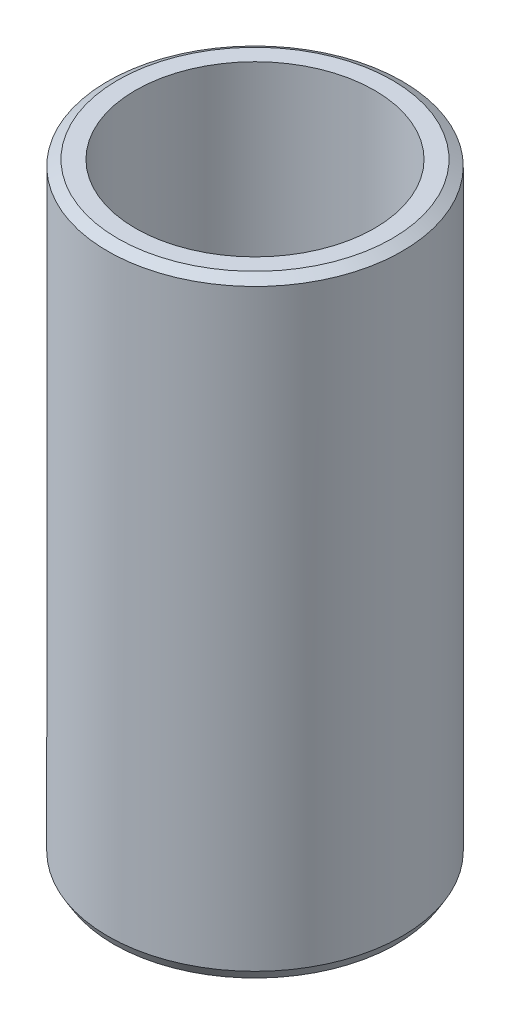
ISO-10303-21;
HEADER;
FILE_DESCRIPTION(('STEP AP214'),'2;1');
FILE_NAME('part.step','',(''),(''),'','','');
FILE_SCHEMA(('AUTOMOTIVE_DESIGN { 1 0 10303 214 1 1 1 1 }'));
ENDSEC;
DATA;
#1=APPLICATION_CONTEXT('core data for automotive mechanical design processes');
#2=APPLICATION_PROTOCOL_DEFINITION('international standard','automotive_design',2000,#1);
#3=PRODUCT_CONTEXT('',#1,'mechanical');
#4=PRODUCT('Part','Part','',(#3));
#5=PRODUCT_RELATED_PRODUCT_CATEGORY('part','',(#4));
#6=PRODUCT_DEFINITION_FORMATION('','',#4);
#7=PRODUCT_DEFINITION_CONTEXT('part definition',#1,'design');
#8=PRODUCT_DEFINITION('design','',#6,#7);
#9=PRODUCT_DEFINITION_SHAPE('','',#8);
#10=(LENGTH_UNIT() NAMED_UNIT(*) SI_UNIT(.MILLI.,.METRE.));
#11=(NAMED_UNIT(*) PLANE_ANGLE_UNIT() SI_UNIT($,.RADIAN.));
#12=(NAMED_UNIT(*) SI_UNIT($,.STERADIAN.) SOLID_ANGLE_UNIT());
#13=UNCERTAINTY_MEASURE_WITH_UNIT(LENGTH_MEASURE(1.E-05),#10,'distance_accuracy_value','');
#14=(GEOMETRIC_REPRESENTATION_CONTEXT(3) GLOBAL_UNCERTAINTY_ASSIGNED_CONTEXT((#13)) GLOBAL_UNIT_ASSIGNED_CONTEXT((#10,
#11,#12)) REPRESENTATION_CONTEXT('',''));
#15=CARTESIAN_POINT('',(0.,0.,0.));
#16=DIRECTION('',(0.,0.,1.));
#17=DIRECTION('',(1.,0.,0.));
#18=AXIS2_PLACEMENT_3D('',#15,#16,#17);
#19=CARTESIAN_POINT('',(0.,196.485747585131,0.));
#20=DIRECTION('',(0.,-1.,0.));
#21=DIRECTION('',(0.,0.,-1.));
#22=AXIS2_PLACEMENT_3D('',#19,#20,#21);
#23=CYLINDRICAL_SURFACE('',#22,47.5);
#24=CARTESIAN_POINT('',(0.,194.548797503286,0.));
#25=DIRECTION('',(0.,1.,0.));
#26=DIRECTION('',(0.,0.,1.));
#27=AXIS2_PLACEMENT_3D('',#24,#25,#26);
#28=CIRCLE('',#27,47.5);
#29=CARTESIAN_POINT('',(0.,194.548797503286,-47.5));
#30=VERTEX_POINT('',#29);
#31=EDGE_CURVE('E50',#30,#30,#28,.F.);
#32=ORIENTED_EDGE('',*,*,#31,.T.);
#33=EDGE_LOOP('',(#32));
#34=FACE_BOUND('',#33,.T.);
#35=CARTESIAN_POINT('',(0.,3.24365106532762,0.));
#36=DIRECTION('',(0.,1.,0.));
#37=DIRECTION('',(0.,0.,1.));
#38=AXIS2_PLACEMENT_3D('',#35,#36,#37);
#39=CIRCLE('',#38,47.5);
#40=CARTESIAN_POINT('',(0.,3.24365106532762,47.5));
#41=VERTEX_POINT('',#40);
#42=EDGE_CURVE('E51',#41,#41,#39,.T.);
#43=ORIENTED_EDGE('',*,*,#42,.T.);
#44=EDGE_LOOP('',(#43));
#45=FACE_BOUND('',#44,.T.);
#46=ADVANCED_FACE('F39',(#34,#45),#23,.T.);
#47=CARTESIAN_POINT('',(0.,196.485747585131,0.));
#48=DIRECTION('',(0.,1.,0.));
#49=DIRECTION('',(0.,0.,1.));
#50=AXIS2_PLACEMENT_3D('',#47,#48,#49);
#51=PLANE('',#50);
#52=CARTESIAN_POINT('',(0.,196.485747585131,0.));
#53=DIRECTION('',(0.,1.,0.));
#54=DIRECTION('',(0.,0.,1.));
#55=AXIS2_PLACEMENT_3D('',#52,#53,#54);
#56=CIRCLE('',#55,44.2563489346723);
#57=CARTESIAN_POINT('',(0.,196.485747585131,-44.2563489346724));
#58=VERTEX_POINT('',#57);
#59=EDGE_CURVE('E54',#58,#58,#56,.T.);
#60=ORIENTED_EDGE('',*,*,#59,.T.);
#61=EDGE_LOOP('',(#60));
#62=FACE_BOUND('',#61,.T.);
#63=CARTESIAN_POINT('',(0.,196.485747585131,0.));
#64=DIRECTION('',(0.,1.,0.));
#65=DIRECTION('',(0.,0.,1.));
#66=AXIS2_PLACEMENT_3D('',#63,#64,#65);
#67=CIRCLE('',#66,38.5580430725887);
#68=CARTESIAN_POINT('',(0.,196.485747585131,38.5580430725887));
#69=VERTEX_POINT('',#68);
#70=EDGE_CURVE('E58',#69,#69,#67,.T.);
#71=ORIENTED_EDGE('',*,*,#70,.F.);
#72=EDGE_LOOP('',(#71));
#73=FACE_BOUND('',#72,.T.);
#74=ADVANCED_FACE('F69',(#62,#73),#51,.T.);
#75=CARTESIAN_POINT('',(0.,0.,0.));
#76=DIRECTION('',(0.,1.,0.));
#77=DIRECTION('',(0.,0.,1.));
#78=AXIS2_PLACEMENT_3D('',#75,#76,#77);
#79=PLANE('',#78);
#80=CARTESIAN_POINT('',(0.,0.,0.));
#81=DIRECTION('',(0.,1.,0.));
#82=DIRECTION('',(0.,0.,1.));
#83=AXIS2_PLACEMENT_3D('',#80,#81,#82);
#84=CIRCLE('',#83,45.5630499181547);
#85=CARTESIAN_POINT('',(0.,0.,45.5630499181547));
#86=VERTEX_POINT('',#85);
#87=EDGE_CURVE('E10',#86,#86,#84,.F.);
#88=ORIENTED_EDGE('',*,*,#87,.T.);
#89=EDGE_LOOP('',(#88));
#90=FACE_BOUND('',#89,.T.);
#91=CARTESIAN_POINT('',(0.,0.,0.));
#92=DIRECTION('',(0.,1.,0.));
#93=DIRECTION('',(0.,0.,1.));
#94=AXIS2_PLACEMENT_3D('',#91,#92,#93);
#95=CIRCLE('',#94,38.5580430725887);
#96=CARTESIAN_POINT('',(0.,0.,38.5580430725887));
#97=VERTEX_POINT('',#96);
#98=EDGE_CURVE('E63',#97,#97,#95,.T.);
#99=ORIENTED_EDGE('',*,*,#98,.T.);
#100=EDGE_LOOP('',(#99));
#101=FACE_BOUND('',#100,.T.);
#102=ADVANCED_FACE('F75',(#90,#101),#79,.F.);
#103=CARTESIAN_POINT('',(0.,196.485747585131,0.));
#104=DIRECTION('',(0.,-1.,0.));
#105=DIRECTION('',(0.,0.,-1.));
#106=AXIS2_PLACEMENT_3D('',#103,#104,#105);
#107=CYLINDRICAL_SURFACE('',#106,38.5580430725887);
#108=ORIENTED_EDGE('',*,*,#70,.T.);
#109=EDGE_LOOP('',(#108));
#110=FACE_BOUND('',#109,.T.);
#111=ORIENTED_EDGE('',*,*,#98,.F.);
#112=EDGE_LOOP('',(#111));
#113=FACE_BOUND('',#112,.T.);
#114=ADVANCED_FACE('F70',(#110,#113),#107,.F.);
#115=CARTESIAN_POINT('',(0.,196.485747585131,0.));
#116=DIRECTION('',(0.,-1.,0.));
#117=DIRECTION('',(0.,0.,-1.));
#118=AXIS2_PLACEMENT_3D('',#115,#116,#117);
#119=CONICAL_SURFACE('',#118,44.2563489346723,1.03247417536392);
#120=CARTESIAN_POINT('',(0.,194.548797503286,-47.5));
#121=CARTESIAN_POINT('',(0.,194.568974066639,-47.4662119680695));
#122=CARTESIAN_POINT('',(0.,194.589150629991,-47.432423936139));
#123=CARTESIAN_POINT('',(0.,194.629503756696,-47.364847872278));
#124=CARTESIAN_POINT('',(0.,194.649680320049,-47.3310598403475));
#125=CARTESIAN_POINT('',(0.,194.690033446754,-47.2634837764866));
#126=CARTESIAN_POINT('',(0.,194.710210010106,-47.2296957445561));
#127=CARTESIAN_POINT('',(0.,194.750563136812,-47.1621196806951));
#128=CARTESIAN_POINT('',(0.,194.770739700164,-47.1283316487646));
#129=CARTESIAN_POINT('',(0.,194.811092826869,-47.0607555849036));
#130=CARTESIAN_POINT('',(0.,194.831269390222,-47.0269675529731));
#131=CARTESIAN_POINT('',(0.,194.871622516927,-46.9593914891121));
#132=CARTESIAN_POINT('',(0.,194.891799080279,-46.9256034571816));
#133=CARTESIAN_POINT('',(0.,194.932152206985,-46.8580273933206));
#134=CARTESIAN_POINT('',(0.,194.952328770337,-46.8242393613901));
#135=CARTESIAN_POINT('',(0.,194.992681897042,-46.7566632975291));
#136=CARTESIAN_POINT('',(0.,195.012858460395,-46.7228752655986));
#137=CARTESIAN_POINT('',(0.,195.0532115871,-46.6552992017376));
#138=CARTESIAN_POINT('',(0.,195.073388150452,-46.6215111698071));
#139=CARTESIAN_POINT('',(0.,195.113741277158,-46.5539351059461));
#140=CARTESIAN_POINT('',(0.,195.13391784051,-46.5201470740156));
#141=CARTESIAN_POINT('',(0.,195.174270967215,-46.4525710101546));
#142=CARTESIAN_POINT('',(0.,195.194447530568,-46.4187829782241));
#143=CARTESIAN_POINT('',(0.,195.234800657273,-46.3512069143632));
#144=CARTESIAN_POINT('',(0.,195.254977220625,-46.3174188824327));
#145=CARTESIAN_POINT('',(0.,195.295330347331,-46.2498428185717));
#146=CARTESIAN_POINT('',(0.,195.315506910683,-46.2160547866412));
#147=CARTESIAN_POINT('',(0.,195.355860037388,-46.1484787227802));
#148=CARTESIAN_POINT('',(0.,195.376036600741,-46.1146906908497));
#149=CARTESIAN_POINT('',(0.,195.416389727446,-46.0471146269887));
#150=CARTESIAN_POINT('',(0.,195.436566290798,-46.0133265950582));
#151=CARTESIAN_POINT('',(0.,195.476919417504,-45.9457505311972));
#152=CARTESIAN_POINT('',(0.,195.497095980856,-45.9119624992667));
#153=CARTESIAN_POINT('',(0.,195.537449107561,-45.8443864354057));
#154=CARTESIAN_POINT('',(0.,195.557625670914,-45.8105984034752));
#155=CARTESIAN_POINT('',(0.,195.597978797619,-45.7430223396142));
#156=CARTESIAN_POINT('',(0.,195.618155360971,-45.7092343076837));
#157=CARTESIAN_POINT('',(0.,195.658508487677,-45.6416582438227));
#158=CARTESIAN_POINT('',(0.,195.678685051029,-45.6078702118922));
#159=CARTESIAN_POINT('',(0.,195.719038177734,-45.5402941480312));
#160=CARTESIAN_POINT('',(0.,195.739214741087,-45.5065061161007));
#161=CARTESIAN_POINT('',(0.,195.779567867792,-45.4389300522397));
#162=CARTESIAN_POINT('',(0.,195.799744431144,-45.4051420203092));
#163=CARTESIAN_POINT('',(0.,195.84009755785,-45.3375659564483));
#164=CARTESIAN_POINT('',(0.,195.860274121202,-45.3037779245178));
#165=CARTESIAN_POINT('',(0.,195.900627247907,-45.2362018606568));
#166=CARTESIAN_POINT('',(0.,195.92080381126,-45.2024138287263));
#167=CARTESIAN_POINT('',(0.,195.961156937965,-45.1348377648653));
#168=CARTESIAN_POINT('',(0.,195.981333501317,-45.1010497329348));
#169=CARTESIAN_POINT('',(0.,196.021686628023,-45.0334736690738));
#170=CARTESIAN_POINT('',(0.,196.041863191375,-44.9996856371433));
#171=CARTESIAN_POINT('',(0.,196.08221631808,-44.9321095732823));
#172=CARTESIAN_POINT('',(0.,196.102392881433,-44.8983215413518));
#173=CARTESIAN_POINT('',(0.,196.142746008138,-44.8307454774908));
#174=CARTESIAN_POINT('',(0.,196.16292257149,-44.7969574455603));
#175=CARTESIAN_POINT('',(0.,196.203275698196,-44.7293813816993));
#176=CARTESIAN_POINT('',(0.,196.223452261548,-44.6955933497688));
#177=CARTESIAN_POINT('',(0.,196.263805388253,-44.6280172859078));
#178=CARTESIAN_POINT('',(0.,196.283981951606,-44.5942292539773));
#179=CARTESIAN_POINT('',(0.,196.324335078311,-44.5266531901163));
#180=CARTESIAN_POINT('',(0.,196.344511641663,-44.4928651581858));
#181=CARTESIAN_POINT('',(0.,196.384864768369,-44.4252890943249));
#182=CARTESIAN_POINT('',(0.,196.405041331721,-44.3915010623944));
#183=CARTESIAN_POINT('',(0.,196.445394458426,-44.3239249985334));
#184=CARTESIAN_POINT('',(0.,196.465571021779,-44.2901369666029));
#185=CARTESIAN_POINT('',(0.,196.485747585131,-44.2563489346724));
#186=B_SPLINE_CURVE_WITH_KNOTS('',3,(#120,#121,#122,#123,#124,#125,#126,#127,#128,#129,#130,
#131,#132,#133,#134,#135,#136,#137,#138,#139,#140,#141,#142,#143,#144,#145,#146,#147,#148,#149,
#150,#151,#152,#153,#154,#155,#156,#157,#158,#159,#160,#161,#162,#163,#164,#165,#166,#167,#168,
#169,#170,#171,#172,#173,#174,#175,#176,#177,#178,#179,#180,#181,#182,#183,#184,#185),
.UNSPECIFIED.,.F.,.F.,(4,2,2,2,2,2,2,2,2,2,2,2,2,2,2,2,2,2,2,2,2,2,2,2,2,2,2,2,2,2,2,2,4),(0.,
0.118061523343147,0.236123046686285,0.354184570029432,0.472246093372571,0.590307616715724,
0.708369140058856,0.826430663402009,0.944492186745142,1.06255371008829,1.18061523343143,
1.29867675677458,1.41673828011773,1.53479980346086,1.652861326804,1.77092285014716,
1.88898437349029,2.00704589683344,2.12510742017657,2.24316894351973,2.36123046686286,
2.47929199020601,2.59735351354915,2.7154150368923,2.83347656023545,2.95153808357859,
3.06959960692174,3.18766113026487,3.30572265360802,3.42378417695116,3.54184570029431,
3.65990722363744,3.7779687469806),.UNSPECIFIED.);
#187=EDGE_CURVE('BSEAM81',#30,#58,#186,.T.);
#188=ORIENTED_EDGE('',*,*,#31,.F.);
#189=ORIENTED_EDGE('',*,*,#59,.F.);
#190=ORIENTED_EDGE('',*,*,#187,.T.);
#191=ORIENTED_EDGE('',*,*,#187,.F.);
#192=EDGE_LOOP('',(#188,#190,#189,#191));
#193=FACE_BOUND('',#192,.T.);
#194=ADVANCED_FACE('F81',(#193),#119,.T.);
#195=CARTESIAN_POINT('',(0.,3.24365106532762,0.));
#196=DIRECTION('',(0.,1.,0.));
#197=DIRECTION('',(0.,0.,1.));
#198=AXIS2_PLACEMENT_3D('',#195,#196,#197);
#199=CONICAL_SURFACE('',#198,47.5,0.538322151430978);
#200=ORIENTED_EDGE('',*,*,#87,.F.);
#201=EDGE_LOOP('',(#200));
#202=FACE_BOUND('',#201,.T.);
#203=ORIENTED_EDGE('',*,*,#42,.F.);
#204=EDGE_LOOP('',(#203));
#205=FACE_BOUND('',#204,.T.);
#206=ADVANCED_FACE('F45',(#202,#205),#199,.T.);
#207=CLOSED_SHELL('',(#46,#74,#102,#114,#194,#206));
#208=MANIFOLD_SOLID_BREP('B2',#207);
#209=ADVANCED_BREP_SHAPE_REPRESENTATION('',(#18,#208),#14);
#210=SHAPE_DEFINITION_REPRESENTATION(#9,#209);
ENDSEC;
END-ISO-10303-21;
